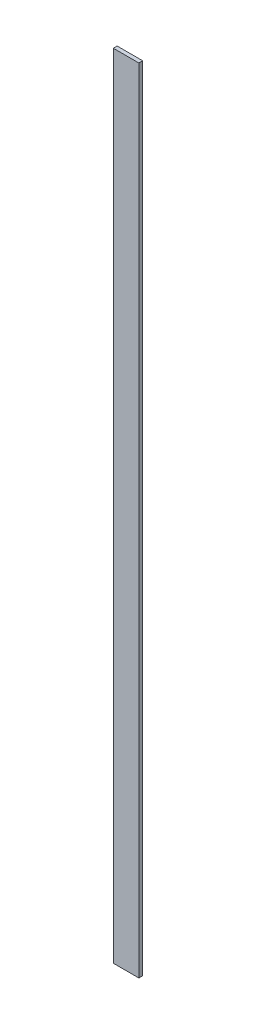
ISO-10303-21;
HEADER;
FILE_DESCRIPTION(('STEP AP214'),'2;1');
FILE_NAME('part.step','',(''),(''),'','','');
FILE_SCHEMA(('AUTOMOTIVE_DESIGN { 1 0 10303 214 1 1 1 1 }'));
ENDSEC;
DATA;
#1=APPLICATION_CONTEXT('core data for automotive mechanical design processes');
#2=APPLICATION_PROTOCOL_DEFINITION('international standard','automotive_design',2000,#1);
#3=PRODUCT_CONTEXT('',#1,'mechanical');
#4=PRODUCT('Part','Part','',(#3));
#5=PRODUCT_RELATED_PRODUCT_CATEGORY('part','',(#4));
#6=PRODUCT_DEFINITION_FORMATION('','',#4);
#7=PRODUCT_DEFINITION_CONTEXT('part definition',#1,'design');
#8=PRODUCT_DEFINITION('design','',#6,#7);
#9=PRODUCT_DEFINITION_SHAPE('','',#8);
#10=(LENGTH_UNIT() NAMED_UNIT(*) SI_UNIT(.MILLI.,.METRE.));
#11=(NAMED_UNIT(*) PLANE_ANGLE_UNIT() SI_UNIT($,.RADIAN.));
#12=(NAMED_UNIT(*) SI_UNIT($,.STERADIAN.) SOLID_ANGLE_UNIT());
#13=UNCERTAINTY_MEASURE_WITH_UNIT(LENGTH_MEASURE(1.E-05),#10,'distance_accuracy_value','');
#14=(GEOMETRIC_REPRESENTATION_CONTEXT(3) GLOBAL_UNCERTAINTY_ASSIGNED_CONTEXT((#13)) GLOBAL_UNIT_ASSIGNED_CONTEXT((#10,
#11,#12)) REPRESENTATION_CONTEXT('',''));
#15=CARTESIAN_POINT('',(0.,0.,0.));
#16=DIRECTION('',(0.,0.,1.));
#17=DIRECTION('',(1.,0.,0.));
#18=AXIS2_PLACEMENT_3D('',#15,#16,#17);
#19=CARTESIAN_POINT('',(-294.293069474716,720.,-49.8111893529998));
#20=DIRECTION('',(-1.,0.,0.));
#21=DIRECTION('',(0.,-1.,0.));
#22=AXIS2_PLACEMENT_3D('',#19,#20,#21);
#23=PLANE('',#22);
#24=DIRECTION('',(0.,1.,0.));
#25=VECTOR('',#24,1.);
#26=CARTESIAN_POINT('',(-294.293069474716,720.,-52.8111893529998));
#27=LINE('',#26,#25);
#28=CARTESIAN_POINT('',(-294.293069474716,100.,-52.8111893529998));
#29=VERTEX_POINT('',#28);
#30=CARTESIAN_POINT('',(-294.293069474716,720.,-52.8111893529998));
#31=VERTEX_POINT('',#30);
#32=EDGE_CURVE('E96',#29,#31,#27,.T.);
#33=ORIENTED_EDGE('',*,*,#32,.T.);
#34=DIRECTION('',(0.,0.,-1.));
#35=VECTOR('',#34,1.);
#36=CARTESIAN_POINT('',(-294.293069474716,720.,-49.8111893529998));
#37=LINE('',#36,#35);
#38=CARTESIAN_POINT('',(-294.293069474716,720.,-49.8111893529998));
#39=VERTEX_POINT('',#38);
#40=EDGE_CURVE('E11',#39,#31,#37,.T.);
#41=ORIENTED_EDGE('',*,*,#40,.F.);
#42=DIRECTION('',(0.,1.,0.));
#43=VECTOR('',#42,1.);
#44=CARTESIAN_POINT('',(-294.293069474716,720.,-49.8111893529998));
#45=LINE('',#44,#43);
#46=CARTESIAN_POINT('',(-294.293069474716,100.,-49.8111893529998));
#47=VERTEX_POINT('',#46);
#48=EDGE_CURVE('E84',#47,#39,#45,.T.);
#49=ORIENTED_EDGE('',*,*,#48,.F.);
#50=DIRECTION('',(0.,0.,-1.));
#51=VECTOR('',#50,1.);
#52=CARTESIAN_POINT('',(-294.293069474716,100.,-49.8111893529998));
#53=LINE('',#52,#51);
#54=EDGE_CURVE('E92',#47,#29,#53,.T.);
#55=ORIENTED_EDGE('',*,*,#54,.T.);
#56=EDGE_LOOP('',(#33,#41,#49,#55));
#57=FACE_BOUND('',#56,.T.);
#58=ADVANCED_FACE('F33',(#57),#23,.F.);
#59=CARTESIAN_POINT('',(-294.293069474716,720.,-49.8111893529998));
#60=DIRECTION('',(0.,-1.,0.));
#61=DIRECTION('',(0.,0.,-1.));
#62=AXIS2_PLACEMENT_3D('',#59,#60,#61);
#63=PLANE('',#62);
#64=DIRECTION('',(-1.,0.,0.));
#65=VECTOR('',#64,1.);
#66=CARTESIAN_POINT('',(-294.293069474716,720.,-52.8111893529998));
#67=LINE('',#66,#65);
#68=CARTESIAN_POINT('',(-314.293069474716,720.,-52.8111893529998));
#69=VERTEX_POINT('',#68);
#70=EDGE_CURVE('E88',#31,#69,#67,.T.);
#71=ORIENTED_EDGE('',*,*,#70,.T.);
#72=DIRECTION('',(0.,0.,-1.));
#73=VECTOR('',#72,1.);
#74=CARTESIAN_POINT('',(-314.293069474716,720.,-49.8111893529998));
#75=LINE('',#74,#73);
#76=CARTESIAN_POINT('',(-314.293069474716,720.,-49.8111893529998));
#77=VERTEX_POINT('',#76);
#78=EDGE_CURVE('E41',#77,#69,#75,.T.);
#79=ORIENTED_EDGE('',*,*,#78,.F.);
#80=DIRECTION('',(-1.,0.,0.));
#81=VECTOR('',#80,1.);
#82=CARTESIAN_POINT('',(-294.293069474716,720.,-49.8111893529998));
#83=LINE('',#82,#81);
#84=EDGE_CURVE('E79',#39,#77,#83,.T.);
#85=ORIENTED_EDGE('',*,*,#84,.F.);
#86=ORIENTED_EDGE('',*,*,#40,.T.);
#87=EDGE_LOOP('',(#71,#79,#85,#86));
#88=FACE_BOUND('',#87,.T.);
#89=ADVANCED_FACE('F87',(#88),#63,.F.);
#90=CARTESIAN_POINT('',(-314.293069474716,720.,-49.8111893529998));
#91=DIRECTION('',(1.,0.,0.));
#92=DIRECTION('',(0.,0.,-1.));
#93=AXIS2_PLACEMENT_3D('',#90,#91,#92);
#94=PLANE('',#93);
#95=DIRECTION('',(0.,-1.,0.));
#96=VECTOR('',#95,1.);
#97=CARTESIAN_POINT('',(-314.293069474716,720.,-52.8111893529998));
#98=LINE('',#97,#96);
#99=CARTESIAN_POINT('',(-314.293069474716,100.,-52.8111893529998));
#100=VERTEX_POINT('',#99);
#101=EDGE_CURVE('E66',#69,#100,#98,.T.);
#102=ORIENTED_EDGE('',*,*,#101,.T.);
#103=DIRECTION('',(0.,0.,-1.));
#104=VECTOR('',#103,1.);
#105=CARTESIAN_POINT('',(-314.293069474716,100.,-49.8111893529998));
#106=LINE('',#105,#104);
#107=CARTESIAN_POINT('',(-314.293069474716,100.,-49.8111893529998));
#108=VERTEX_POINT('',#107);
#109=EDGE_CURVE('E89',#108,#100,#106,.T.);
#110=ORIENTED_EDGE('',*,*,#109,.F.);
#111=DIRECTION('',(0.,-1.,0.));
#112=VECTOR('',#111,1.);
#113=CARTESIAN_POINT('',(-314.293069474716,720.,-49.8111893529998));
#114=LINE('',#113,#112);
#115=EDGE_CURVE('E82',#77,#108,#114,.T.);
#116=ORIENTED_EDGE('',*,*,#115,.F.);
#117=ORIENTED_EDGE('',*,*,#78,.T.);
#118=EDGE_LOOP('',(#102,#110,#116,#117));
#119=FACE_BOUND('',#118,.T.);
#120=ADVANCED_FACE('F90',(#119),#94,.F.);
#121=CARTESIAN_POINT('',(-294.293069474716,100.,-49.8111893529998));
#122=DIRECTION('',(0.,1.,0.));
#123=DIRECTION('',(0.,0.,1.));
#124=AXIS2_PLACEMENT_3D('',#121,#122,#123);
#125=PLANE('',#124);
#126=DIRECTION('',(1.,0.,0.));
#127=VECTOR('',#126,1.);
#128=CARTESIAN_POINT('',(-294.293069474716,100.,-52.8111893529998));
#129=LINE('',#128,#127);
#130=EDGE_CURVE('E72',#100,#29,#129,.T.);
#131=ORIENTED_EDGE('',*,*,#130,.T.);
#132=ORIENTED_EDGE('',*,*,#54,.F.);
#133=DIRECTION('',(1.,0.,0.));
#134=VECTOR('',#133,1.);
#135=CARTESIAN_POINT('',(-294.293069474716,100.,-49.8111893529998));
#136=LINE('',#135,#134);
#137=EDGE_CURVE('E49',#108,#47,#136,.T.);
#138=ORIENTED_EDGE('',*,*,#137,.F.);
#139=ORIENTED_EDGE('',*,*,#109,.T.);
#140=EDGE_LOOP('',(#131,#132,#138,#139));
#141=FACE_BOUND('',#140,.T.);
#142=ADVANCED_FACE('F103',(#141),#125,.F.);
#143=CARTESIAN_POINT('',(-294.293069474716,100.,-49.8111893529998));
#144=DIRECTION('',(0.,0.,-1.));
#145=DIRECTION('',(-1.,0.,0.));
#146=AXIS2_PLACEMENT_3D('',#143,#144,#145);
#147=PLANE('',#146);
#148=ORIENTED_EDGE('',*,*,#48,.T.);
#149=ORIENTED_EDGE('',*,*,#84,.T.);
#150=ORIENTED_EDGE('',*,*,#115,.T.);
#151=ORIENTED_EDGE('',*,*,#137,.T.);
#152=EDGE_LOOP('',(#148,#149,#150,#151));
#153=FACE_BOUND('',#152,.T.);
#154=ADVANCED_FACE('F80',(#153),#147,.F.);
#155=CARTESIAN_POINT('',(-294.293069474716,100.,-52.8111893529998));
#156=DIRECTION('',(0.,0.,-1.));
#157=DIRECTION('',(-1.,0.,0.));
#158=AXIS2_PLACEMENT_3D('',#155,#156,#157);
#159=PLANE('',#158);
#160=ORIENTED_EDGE('',*,*,#32,.F.);
#161=ORIENTED_EDGE('',*,*,#130,.F.);
#162=ORIENTED_EDGE('',*,*,#101,.F.);
#163=ORIENTED_EDGE('',*,*,#70,.F.);
#164=EDGE_LOOP('',(#160,#161,#162,#163));
#165=FACE_BOUND('',#164,.T.);
#166=ADVANCED_FACE('F106',(#165),#159,.T.);
#167=CLOSED_SHELL('',(#58,#89,#120,#142,#154,#166));
#168=MANIFOLD_SOLID_BREP('B2',#167);
#169=ADVANCED_BREP_SHAPE_REPRESENTATION('',(#18,#168),#14);
#170=SHAPE_DEFINITION_REPRESENTATION(#9,#169);
ENDSEC;
END-ISO-10303-21;
